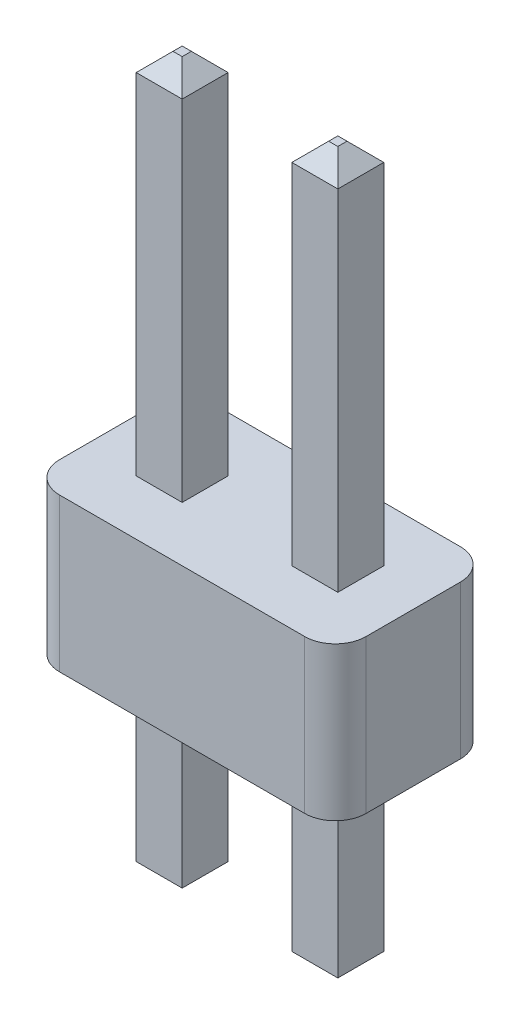
ISO-10303-21;
HEADER;
FILE_DESCRIPTION(('STEP AP214'),'2;1');
FILE_NAME('part.step','',(''),(''),'','','');
FILE_SCHEMA(('AUTOMOTIVE_DESIGN { 1 0 10303 214 1 1 1 1 }'));
ENDSEC;
DATA;
#1=APPLICATION_CONTEXT('core data for automotive mechanical design processes');
#2=APPLICATION_PROTOCOL_DEFINITION('international standard','automotive_design',2000,#1);
#3=PRODUCT_CONTEXT('',#1,'mechanical');
#4=PRODUCT('Part','Part','',(#3));
#5=PRODUCT_RELATED_PRODUCT_CATEGORY('part','',(#4));
#6=PRODUCT_DEFINITION_FORMATION('','',#4);
#7=PRODUCT_DEFINITION_CONTEXT('part definition',#1,'design');
#8=PRODUCT_DEFINITION('design','',#6,#7);
#9=PRODUCT_DEFINITION_SHAPE('','',#8);
#10=(LENGTH_UNIT() NAMED_UNIT(*) SI_UNIT(.MILLI.,.METRE.));
#11=(NAMED_UNIT(*) PLANE_ANGLE_UNIT() SI_UNIT($,.RADIAN.));
#12=(NAMED_UNIT(*) SI_UNIT($,.STERADIAN.) SOLID_ANGLE_UNIT());
#13=UNCERTAINTY_MEASURE_WITH_UNIT(LENGTH_MEASURE(1.E-05),#10,'distance_accuracy_value','');
#14=(GEOMETRIC_REPRESENTATION_CONTEXT(3) GLOBAL_UNCERTAINTY_ASSIGNED_CONTEXT((#13)) GLOBAL_UNIT_ASSIGNED_CONTEXT((#10,
#11,#12)) REPRESENTATION_CONTEXT('',''));
#15=CARTESIAN_POINT('',(0.,0.,0.));
#16=DIRECTION('',(0.,0.,1.));
#17=DIRECTION('',(1.,0.,0.));
#18=AXIS2_PLACEMENT_3D('',#15,#16,#17);
#19=CARTESIAN_POINT('',(2.,2.5,0.77));
#20=DIRECTION('',(0.,-1.,0.));
#21=DIRECTION('',(0.,0.,-1.));
#22=AXIS2_PLACEMENT_3D('',#19,#20,#21);
#23=CYLINDRICAL_SURFACE('',#22,0.5);
#24=CARTESIAN_POINT('',(2.,0.,0.77));
#25=DIRECTION('',(0.,1.,0.));
#26=DIRECTION('',(0.,0.,1.));
#27=AXIS2_PLACEMENT_3D('',#24,#25,#26);
#28=CIRCLE('',#27,0.5);
#29=CARTESIAN_POINT('',(2.,0.,1.27));
#30=VERTEX_POINT('',#29);
#31=CARTESIAN_POINT('',(2.5,0.,0.77));
#32=VERTEX_POINT('',#31);
#33=EDGE_CURVE('E303',#30,#32,#28,.T.);
#34=ORIENTED_EDGE('',*,*,#33,.T.);
#35=DIRECTION('',(0.,-1.,0.));
#36=VECTOR('',#35,1.);
#37=CARTESIAN_POINT('',(2.5,2.5,0.77));
#38=LINE('',#37,#36);
#39=CARTESIAN_POINT('',(2.5,2.5,0.77));
#40=VERTEX_POINT('',#39);
#41=EDGE_CURVE('E358',#40,#32,#38,.T.);
#42=ORIENTED_EDGE('',*,*,#41,.F.);
#43=CARTESIAN_POINT('',(2.,2.5,0.77));
#44=DIRECTION('',(0.,1.,0.));
#45=DIRECTION('',(0.,0.,1.));
#46=AXIS2_PLACEMENT_3D('',#43,#44,#45);
#47=CIRCLE('',#46,0.5);
#48=CARTESIAN_POINT('',(2.,2.5,1.27));
#49=VERTEX_POINT('',#48);
#50=EDGE_CURVE('E304',#49,#40,#47,.T.);
#51=ORIENTED_EDGE('',*,*,#50,.F.);
#52=DIRECTION('',(0.,-1.,0.));
#53=VECTOR('',#52,1.);
#54=CARTESIAN_POINT('',(2.,2.5,1.27));
#55=LINE('',#54,#53);
#56=EDGE_CURVE('E322',#49,#30,#55,.T.);
#57=ORIENTED_EDGE('',*,*,#56,.T.);
#58=EDGE_LOOP('',(#34,#42,#51,#57));
#59=FACE_BOUND('',#58,.T.);
#60=ADVANCED_FACE('F37',(#59),#23,.T.);
#61=CARTESIAN_POINT('',(2.5,2.5,-0.77));
#62=DIRECTION('',(-1.,0.,0.));
#63=DIRECTION('',(0.,0.,1.));
#64=AXIS2_PLACEMENT_3D('',#61,#62,#63);
#65=PLANE('',#64);
#66=DIRECTION('',(0.,0.,-1.));
#67=VECTOR('',#66,1.);
#68=CARTESIAN_POINT('',(2.5,0.,-0.77));
#69=LINE('',#68,#67);
#70=CARTESIAN_POINT('',(2.5,0.,-0.77));
#71=VERTEX_POINT('',#70);
#72=EDGE_CURVE('E325',#32,#71,#69,.T.);
#73=ORIENTED_EDGE('',*,*,#72,.T.);
#74=DIRECTION('',(0.,-1.,0.));
#75=VECTOR('',#74,1.);
#76=CARTESIAN_POINT('',(2.5,2.5,-0.77));
#77=LINE('',#76,#75);
#78=CARTESIAN_POINT('',(2.5,2.5,-0.77));
#79=VERTEX_POINT('',#78);
#80=EDGE_CURVE('E355',#79,#71,#77,.T.);
#81=ORIENTED_EDGE('',*,*,#80,.F.);
#82=DIRECTION('',(0.,0.,-1.));
#83=VECTOR('',#82,1.);
#84=CARTESIAN_POINT('',(2.5,2.5,-0.77));
#85=LINE('',#84,#83);
#86=EDGE_CURVE('E307',#40,#79,#85,.T.);
#87=ORIENTED_EDGE('',*,*,#86,.F.);
#88=ORIENTED_EDGE('',*,*,#41,.T.);
#89=EDGE_LOOP('',(#73,#81,#87,#88));
#90=FACE_BOUND('',#89,.T.);
#91=ADVANCED_FACE('F524',(#90),#65,.F.);
#92=CARTESIAN_POINT('',(2.,2.5,-0.77));
#93=DIRECTION('',(0.,-1.,0.));
#94=DIRECTION('',(0.,0.,-1.));
#95=AXIS2_PLACEMENT_3D('',#92,#93,#94);
#96=CYLINDRICAL_SURFACE('',#95,0.5);
#97=CARTESIAN_POINT('',(2.,0.,-0.77));
#98=DIRECTION('',(0.,1.,0.));
#99=DIRECTION('',(0.,0.,1.));
#100=AXIS2_PLACEMENT_3D('',#97,#98,#99);
#101=CIRCLE('',#100,0.5);
#102=CARTESIAN_POINT('',(2.,0.,-1.27));
#103=VERTEX_POINT('',#102);
#104=EDGE_CURVE('E327',#71,#103,#101,.T.);
#105=ORIENTED_EDGE('',*,*,#104,.T.);
#106=DIRECTION('',(0.,-1.,0.));
#107=VECTOR('',#106,1.);
#108=CARTESIAN_POINT('',(2.,2.5,-1.27));
#109=LINE('',#108,#107);
#110=CARTESIAN_POINT('',(2.,2.5,-1.27));
#111=VERTEX_POINT('',#110);
#112=EDGE_CURVE('E352',#111,#103,#109,.T.);
#113=ORIENTED_EDGE('',*,*,#112,.F.);
#114=CARTESIAN_POINT('',(2.,2.5,-0.77));
#115=DIRECTION('',(0.,1.,0.));
#116=DIRECTION('',(0.,0.,1.));
#117=AXIS2_PLACEMENT_3D('',#114,#115,#116);
#118=CIRCLE('',#117,0.5);
#119=EDGE_CURVE('E310',#79,#111,#118,.T.);
#120=ORIENTED_EDGE('',*,*,#119,.F.);
#121=ORIENTED_EDGE('',*,*,#80,.T.);
#122=EDGE_LOOP('',(#105,#113,#120,#121));
#123=FACE_BOUND('',#122,.T.);
#124=ADVANCED_FACE('F530',(#123),#96,.T.);
#125=CARTESIAN_POINT('',(-2.,2.5,-1.27));
#126=DIRECTION('',(0.,0.,1.));
#127=DIRECTION('',(1.,0.,0.));
#128=AXIS2_PLACEMENT_3D('',#125,#126,#127);
#129=PLANE('',#128);
#130=DIRECTION('',(-1.,0.,0.));
#131=VECTOR('',#130,1.);
#132=CARTESIAN_POINT('',(-2.,0.,-1.27));
#133=LINE('',#132,#131);
#134=CARTESIAN_POINT('',(-2.,0.,-1.27));
#135=VERTEX_POINT('',#134);
#136=EDGE_CURVE('E329',#103,#135,#133,.T.);
#137=ORIENTED_EDGE('',*,*,#136,.T.);
#138=DIRECTION('',(0.,-1.,0.));
#139=VECTOR('',#138,1.);
#140=CARTESIAN_POINT('',(-2.,2.5,-1.27));
#141=LINE('',#140,#139);
#142=CARTESIAN_POINT('',(-2.,2.5,-1.27));
#143=VERTEX_POINT('',#142);
#144=EDGE_CURVE('E349',#143,#135,#141,.T.);
#145=ORIENTED_EDGE('',*,*,#144,.F.);
#146=DIRECTION('',(-1.,0.,0.));
#147=VECTOR('',#146,1.);
#148=CARTESIAN_POINT('',(-2.,2.5,-1.27));
#149=LINE('',#148,#147);
#150=EDGE_CURVE('E312',#111,#143,#149,.T.);
#151=ORIENTED_EDGE('',*,*,#150,.F.);
#152=ORIENTED_EDGE('',*,*,#112,.T.);
#153=EDGE_LOOP('',(#137,#145,#151,#152));
#154=FACE_BOUND('',#153,.T.);
#155=ADVANCED_FACE('F874',(#154),#129,.F.);
#156=CARTESIAN_POINT('',(-2.,2.5,-0.77));
#157=DIRECTION('',(0.,-1.,0.));
#158=DIRECTION('',(0.,0.,-1.));
#159=AXIS2_PLACEMENT_3D('',#156,#157,#158);
#160=CYLINDRICAL_SURFACE('',#159,0.5);
#161=CARTESIAN_POINT('',(-2.,0.,-0.77));
#162=DIRECTION('',(0.,1.,0.));
#163=DIRECTION('',(0.,0.,1.));
#164=AXIS2_PLACEMENT_3D('',#161,#162,#163);
#165=CIRCLE('',#164,0.5);
#166=CARTESIAN_POINT('',(-2.5,0.,-0.77));
#167=VERTEX_POINT('',#166);
#168=EDGE_CURVE('E331',#135,#167,#165,.T.);
#169=ORIENTED_EDGE('',*,*,#168,.T.);
#170=DIRECTION('',(0.,-1.,0.));
#171=VECTOR('',#170,1.);
#172=CARTESIAN_POINT('',(-2.5,2.5,-0.77));
#173=LINE('',#172,#171);
#174=CARTESIAN_POINT('',(-2.5,2.5,-0.77));
#175=VERTEX_POINT('',#174);
#176=EDGE_CURVE('E346',#175,#167,#173,.T.);
#177=ORIENTED_EDGE('',*,*,#176,.F.);
#178=CARTESIAN_POINT('',(-2.,2.5,-0.77));
#179=DIRECTION('',(0.,1.,0.));
#180=DIRECTION('',(0.,0.,1.));
#181=AXIS2_PLACEMENT_3D('',#178,#179,#180);
#182=CIRCLE('',#181,0.5);
#183=EDGE_CURVE('E314',#143,#175,#182,.T.);
#184=ORIENTED_EDGE('',*,*,#183,.F.);
#185=ORIENTED_EDGE('',*,*,#144,.T.);
#186=EDGE_LOOP('',(#169,#177,#184,#185));
#187=FACE_BOUND('',#186,.T.);
#188=ADVANCED_FACE('F863',(#187),#160,.T.);
#189=CARTESIAN_POINT('',(-2.5,2.5,0.77));
#190=DIRECTION('',(1.,0.,0.));
#191=DIRECTION('',(0.,0.,-1.));
#192=AXIS2_PLACEMENT_3D('',#189,#190,#191);
#193=PLANE('',#192);
#194=DIRECTION('',(0.,0.,1.));
#195=VECTOR('',#194,1.);
#196=CARTESIAN_POINT('',(-2.5,0.,0.77));
#197=LINE('',#196,#195);
#198=CARTESIAN_POINT('',(-2.5,0.,0.77));
#199=VERTEX_POINT('',#198);
#200=EDGE_CURVE('E333',#167,#199,#197,.T.);
#201=ORIENTED_EDGE('',*,*,#200,.T.);
#202=DIRECTION('',(0.,-1.,0.));
#203=VECTOR('',#202,1.);
#204=CARTESIAN_POINT('',(-2.5,2.5,0.77));
#205=LINE('',#204,#203);
#206=CARTESIAN_POINT('',(-2.5,2.5,0.77));
#207=VERTEX_POINT('',#206);
#208=EDGE_CURVE('E343',#207,#199,#205,.T.);
#209=ORIENTED_EDGE('',*,*,#208,.F.);
#210=DIRECTION('',(0.,0.,1.));
#211=VECTOR('',#210,1.);
#212=CARTESIAN_POINT('',(-2.5,2.5,0.77));
#213=LINE('',#212,#211);
#214=EDGE_CURVE('E316',#175,#207,#213,.T.);
#215=ORIENTED_EDGE('',*,*,#214,.F.);
#216=ORIENTED_EDGE('',*,*,#176,.T.);
#217=EDGE_LOOP('',(#201,#209,#215,#216));
#218=FACE_BOUND('',#217,.T.);
#219=ADVANCED_FACE('F852',(#218),#193,.F.);
#220=CARTESIAN_POINT('',(-2.,2.5,0.77));
#221=DIRECTION('',(0.,-1.,0.));
#222=DIRECTION('',(0.,0.,-1.));
#223=AXIS2_PLACEMENT_3D('',#220,#221,#222);
#224=CYLINDRICAL_SURFACE('',#223,0.5);
#225=CARTESIAN_POINT('',(-2.,0.,0.77));
#226=DIRECTION('',(0.,1.,0.));
#227=DIRECTION('',(0.,0.,1.));
#228=AXIS2_PLACEMENT_3D('',#225,#226,#227);
#229=CIRCLE('',#228,0.5);
#230=CARTESIAN_POINT('',(-2.,0.,1.27));
#231=VERTEX_POINT('',#230);
#232=EDGE_CURVE('E335',#199,#231,#229,.T.);
#233=ORIENTED_EDGE('',*,*,#232,.T.);
#234=DIRECTION('',(0.,-1.,0.));
#235=VECTOR('',#234,1.);
#236=CARTESIAN_POINT('',(-2.,2.5,1.27));
#237=LINE('',#236,#235);
#238=CARTESIAN_POINT('',(-2.,2.5,1.27));
#239=VERTEX_POINT('',#238);
#240=EDGE_CURVE('E340',#239,#231,#237,.T.);
#241=ORIENTED_EDGE('',*,*,#240,.F.);
#242=CARTESIAN_POINT('',(-2.,2.5,0.77));
#243=DIRECTION('',(0.,1.,0.));
#244=DIRECTION('',(0.,0.,1.));
#245=AXIS2_PLACEMENT_3D('',#242,#243,#244);
#246=CIRCLE('',#245,0.5);
#247=EDGE_CURVE('E318',#207,#239,#246,.T.);
#248=ORIENTED_EDGE('',*,*,#247,.F.);
#249=ORIENTED_EDGE('',*,*,#208,.T.);
#250=EDGE_LOOP('',(#233,#241,#248,#249));
#251=FACE_BOUND('',#250,.T.);
#252=ADVANCED_FACE('F841',(#251),#224,.T.);
#253=CARTESIAN_POINT('',(2.,2.5,1.27));
#254=DIRECTION('',(0.,0.,-1.));
#255=DIRECTION('',(-1.,0.,0.));
#256=AXIS2_PLACEMENT_3D('',#253,#254,#255);
#257=PLANE('',#256);
#258=DIRECTION('',(1.,0.,0.));
#259=VECTOR('',#258,1.);
#260=CARTESIAN_POINT('',(2.,0.,1.27));
#261=LINE('',#260,#259);
#262=EDGE_CURVE('E308',#231,#30,#261,.T.);
#263=ORIENTED_EDGE('',*,*,#262,.T.);
#264=ORIENTED_EDGE('',*,*,#56,.F.);
#265=DIRECTION('',(1.,0.,0.));
#266=VECTOR('',#265,1.);
#267=CARTESIAN_POINT('',(2.,2.5,1.27));
#268=LINE('',#267,#266);
#269=EDGE_CURVE('E320',#239,#49,#268,.T.);
#270=ORIENTED_EDGE('',*,*,#269,.F.);
#271=ORIENTED_EDGE('',*,*,#240,.T.);
#272=EDGE_LOOP('',(#263,#264,#270,#271));
#273=FACE_BOUND('',#272,.T.);
#274=ADVANCED_FACE('F831',(#273),#257,.F.);
#275=CARTESIAN_POINT('',(2.,2.5,0.77));
#276=DIRECTION('',(0.,1.,0.));
#277=DIRECTION('',(0.,0.,1.));
#278=AXIS2_PLACEMENT_3D('',#275,#276,#277);
#279=PLANE('',#278);
#280=DIRECTION('',(0.,0.,1.));
#281=VECTOR('',#280,1.);
#282=CARTESIAN_POINT('',(0.895,2.5,0.77));
#283=LINE('',#282,#281);
#284=CARTESIAN_POINT('',(0.895,2.5,-0.375));
#285=VERTEX_POINT('',#284);
#286=CARTESIAN_POINT('',(0.895,2.5,0.375));
#287=VERTEX_POINT('',#286);
#288=EDGE_CURVE('E277',#285,#287,#283,.T.);
#289=ORIENTED_EDGE('',*,*,#288,.F.);
#290=DIRECTION('',(-1.,0.,0.));
#291=VECTOR('',#290,1.);
#292=CARTESIAN_POINT('',(2.,2.5,-0.375));
#293=LINE('',#292,#291);
#294=CARTESIAN_POINT('',(1.645,2.5,-0.375));
#295=VERTEX_POINT('',#294);
#296=EDGE_CURVE('E255',#295,#285,#293,.T.);
#297=ORIENTED_EDGE('',*,*,#296,.F.);
#298=DIRECTION('',(0.,0.,-1.));
#299=VECTOR('',#298,1.);
#300=CARTESIAN_POINT('',(1.645,2.5,0.77));
#301=LINE('',#300,#299);
#302=CARTESIAN_POINT('',(1.645,2.5,0.375));
#303=VERTEX_POINT('',#302);
#304=EDGE_CURVE('E248',#303,#295,#301,.T.);
#305=ORIENTED_EDGE('',*,*,#304,.F.);
#306=DIRECTION('',(1.,0.,0.));
#307=VECTOR('',#306,1.);
#308=CARTESIAN_POINT('',(2.,2.5,0.375));
#309=LINE('',#308,#307);
#310=EDGE_CURVE('E252',#287,#303,#309,.T.);
#311=ORIENTED_EDGE('',*,*,#310,.F.);
#312=EDGE_LOOP('',(#289,#297,#305,#311));
#313=FACE_BOUND('',#312,.T.);
#314=DIRECTION('',(0.,0.,-1.));
#315=VECTOR('',#314,1.);
#316=CARTESIAN_POINT('',(-0.895,2.5,0.77));
#317=LINE('',#316,#315);
#318=CARTESIAN_POINT('',(-0.895,2.5,0.375));
#319=VERTEX_POINT('',#318);
#320=CARTESIAN_POINT('',(-0.895,2.5,-0.375));
#321=VERTEX_POINT('',#320);
#322=EDGE_CURVE('E300',#319,#321,#317,.T.);
#323=ORIENTED_EDGE('',*,*,#322,.F.);
#324=DIRECTION('',(1.,0.,0.));
#325=VECTOR('',#324,1.);
#326=CARTESIAN_POINT('',(2.,2.5,0.375));
#327=LINE('',#326,#325);
#328=CARTESIAN_POINT('',(-1.645,2.5,0.375));
#329=VERTEX_POINT('',#328);
#330=EDGE_CURVE('E297',#329,#319,#327,.T.);
#331=ORIENTED_EDGE('',*,*,#330,.F.);
#332=DIRECTION('',(0.,0.,1.));
#333=VECTOR('',#332,1.);
#334=CARTESIAN_POINT('',(-1.645,2.5,0.77));
#335=LINE('',#334,#333);
#336=CARTESIAN_POINT('',(-1.645,2.5,-0.375));
#337=VERTEX_POINT('',#336);
#338=EDGE_CURVE('E294',#337,#329,#335,.T.);
#339=ORIENTED_EDGE('',*,*,#338,.F.);
#340=DIRECTION('',(-1.,0.,0.));
#341=VECTOR('',#340,1.);
#342=CARTESIAN_POINT('',(2.,2.5,-0.375));
#343=LINE('',#342,#341);
#344=EDGE_CURVE('E282',#321,#337,#343,.T.);
#345=ORIENTED_EDGE('',*,*,#344,.F.);
#346=EDGE_LOOP('',(#323,#331,#339,#345));
#347=FACE_BOUND('',#346,.T.);
#348=ORIENTED_EDGE('',*,*,#50,.T.);
#349=ORIENTED_EDGE('',*,*,#86,.T.);
#350=ORIENTED_EDGE('',*,*,#119,.T.);
#351=ORIENTED_EDGE('',*,*,#150,.T.);
#352=ORIENTED_EDGE('',*,*,#183,.T.);
#353=ORIENTED_EDGE('',*,*,#214,.T.);
#354=ORIENTED_EDGE('',*,*,#247,.T.);
#355=ORIENTED_EDGE('',*,*,#269,.T.);
#356=EDGE_LOOP('',(#348,#349,#350,#351,#352,#353,#354,#355));
#357=FACE_BOUND('',#356,.T.);
#358=ADVANCED_FACE('F250',(#313,#347,#357),#279,.T.);
#359=CARTESIAN_POINT('',(2.,0.,0.77));
#360=DIRECTION('',(0.,1.,0.));
#361=DIRECTION('',(0.,0.,1.));
#362=AXIS2_PLACEMENT_3D('',#359,#360,#361);
#363=PLANE('',#362);
#364=DIRECTION('',(-1.,0.,0.));
#365=VECTOR('',#364,1.);
#366=CARTESIAN_POINT('',(2.,0.,-0.375));
#367=LINE('',#366,#365);
#368=CARTESIAN_POINT('',(1.645,0.,-0.375));
#369=VERTEX_POINT('',#368);
#370=CARTESIAN_POINT('',(0.895,0.,-0.375));
#371=VERTEX_POINT('',#370);
#372=EDGE_CURVE('E379',#369,#371,#367,.T.);
#373=ORIENTED_EDGE('',*,*,#372,.T.);
#374=DIRECTION('',(0.,0.,1.));
#375=VECTOR('',#374,1.);
#376=CARTESIAN_POINT('',(0.895,0.,0.77));
#377=LINE('',#376,#375);
#378=CARTESIAN_POINT('',(0.895,0.,0.375));
#379=VERTEX_POINT('',#378);
#380=EDGE_CURVE('E382',#371,#379,#377,.T.);
#381=ORIENTED_EDGE('',*,*,#380,.T.);
#382=DIRECTION('',(1.,0.,0.));
#383=VECTOR('',#382,1.);
#384=CARTESIAN_POINT('',(2.,0.,0.375));
#385=LINE('',#384,#383);
#386=CARTESIAN_POINT('',(1.645,0.,0.375));
#387=VERTEX_POINT('',#386);
#388=EDGE_CURVE('E373',#379,#387,#385,.T.);
#389=ORIENTED_EDGE('',*,*,#388,.T.);
#390=DIRECTION('',(0.,0.,-1.));
#391=VECTOR('',#390,1.);
#392=CARTESIAN_POINT('',(1.645,0.,0.77));
#393=LINE('',#392,#391);
#394=EDGE_CURVE('E376',#387,#369,#393,.T.);
#395=ORIENTED_EDGE('',*,*,#394,.T.);
#396=EDGE_LOOP('',(#373,#381,#389,#395));
#397=FACE_BOUND('',#396,.T.);
#398=DIRECTION('',(1.,0.,0.));
#399=VECTOR('',#398,1.);
#400=CARTESIAN_POINT('',(2.,0.,0.375));
#401=LINE('',#400,#399);
#402=CARTESIAN_POINT('',(-1.645,0.,0.375));
#403=VERTEX_POINT('',#402);
#404=CARTESIAN_POINT('',(-0.895,0.,0.375));
#405=VERTEX_POINT('',#404);
#406=EDGE_CURVE('E367',#403,#405,#401,.T.);
#407=ORIENTED_EDGE('',*,*,#406,.T.);
#408=DIRECTION('',(0.,0.,-1.));
#409=VECTOR('',#408,1.);
#410=CARTESIAN_POINT('',(-0.895,0.,0.77));
#411=LINE('',#410,#409);
#412=CARTESIAN_POINT('',(-0.895,0.,-0.375));
#413=VERTEX_POINT('',#412);
#414=EDGE_CURVE('E370',#405,#413,#411,.T.);
#415=ORIENTED_EDGE('',*,*,#414,.T.);
#416=DIRECTION('',(-1.,0.,0.));
#417=VECTOR('',#416,1.);
#418=CARTESIAN_POINT('',(2.,0.,-0.375));
#419=LINE('',#418,#417);
#420=CARTESIAN_POINT('',(-1.645,0.,-0.375));
#421=VERTEX_POINT('',#420);
#422=EDGE_CURVE('E361',#413,#421,#419,.T.);
#423=ORIENTED_EDGE('',*,*,#422,.T.);
#424=DIRECTION('',(0.,0.,1.));
#425=VECTOR('',#424,1.);
#426=CARTESIAN_POINT('',(-1.645,0.,0.77));
#427=LINE('',#426,#425);
#428=EDGE_CURVE('E364',#421,#403,#427,.T.);
#429=ORIENTED_EDGE('',*,*,#428,.T.);
#430=EDGE_LOOP('',(#407,#415,#423,#429));
#431=FACE_BOUND('',#430,.T.);
#432=ORIENTED_EDGE('',*,*,#33,.F.);
#433=ORIENTED_EDGE('',*,*,#262,.F.);
#434=ORIENTED_EDGE('',*,*,#232,.F.);
#435=ORIENTED_EDGE('',*,*,#200,.F.);
#436=ORIENTED_EDGE('',*,*,#168,.F.);
#437=ORIENTED_EDGE('',*,*,#136,.F.);
#438=ORIENTED_EDGE('',*,*,#104,.F.);
#439=ORIENTED_EDGE('',*,*,#72,.F.);
#440=EDGE_LOOP('',(#432,#433,#434,#435,#436,#437,#438,#439));
#441=FACE_BOUND('',#440,.T.);
#442=ADVANCED_FACE('F810',(#397,#431,#441),#363,.F.);
#443=CARTESIAN_POINT('',(0.,-3.25,0.));
#444=DIRECTION('',(0.,-1.,0.));
#445=DIRECTION('',(0.,0.,-1.));
#446=AXIS2_PLACEMENT_3D('',#443,#444,#445);
#447=PLANE('',#446);
#448=DIRECTION('',(0.,0.,1.));
#449=VECTOR('',#448,1.);
#450=CARTESIAN_POINT('',(-1.195,-3.25,0.));
#451=LINE('',#450,#449);
#452=CARTESIAN_POINT('',(-1.195,-3.25,-0.0750000000000004));
#453=VERTEX_POINT('',#452);
#454=CARTESIAN_POINT('',(-1.195,-3.25,0.075));
#455=VERTEX_POINT('',#454);
#456=EDGE_CURVE('E408',#453,#455,#451,.T.);
#457=ORIENTED_EDGE('',*,*,#456,.T.);
#458=DIRECTION('',(-1.,0.,0.));
#459=VECTOR('',#458,1.);
#460=CARTESIAN_POINT('',(0.,-3.25,0.075));
#461=LINE('',#460,#459);
#462=CARTESIAN_POINT('',(-1.345,-3.25,0.075));
#463=VERTEX_POINT('',#462);
#464=EDGE_CURVE('E412',#455,#463,#461,.T.);
#465=ORIENTED_EDGE('',*,*,#464,.T.);
#466=DIRECTION('',(0.,0.,-1.));
#467=VECTOR('',#466,1.);
#468=CARTESIAN_POINT('',(-1.345,-3.25,0.));
#469=LINE('',#468,#467);
#470=CARTESIAN_POINT('',(-1.345,-3.25,-0.0750000000000004));
#471=VERTEX_POINT('',#470);
#472=EDGE_CURVE('E410',#463,#471,#469,.T.);
#473=ORIENTED_EDGE('',*,*,#472,.T.);
#474=DIRECTION('',(1.,0.,0.));
#475=VECTOR('',#474,1.);
#476=CARTESIAN_POINT('',(0.,-3.25,-0.0750000000000004));
#477=LINE('',#476,#475);
#478=EDGE_CURVE('E406',#471,#453,#477,.T.);
#479=ORIENTED_EDGE('',*,*,#478,.T.);
#480=EDGE_LOOP('',(#457,#465,#473,#479));
#481=FACE_BOUND('',#480,.T.);
#482=ADVANCED_FACE('F801',(#481),#447,.T.);
#483=CARTESIAN_POINT('',(-1.645,-3.25,-0.375));
#484=DIRECTION('',(0.,0.,-1.));
#485=DIRECTION('',(-1.,0.,0.));
#486=AXIS2_PLACEMENT_3D('',#483,#484,#485);
#487=PLANE('',#486);
#488=DIRECTION('',(0.,1.,0.));
#489=VECTOR('',#488,1.);
#490=CARTESIAN_POINT('',(-0.895,-3.25,-0.375));
#491=LINE('',#490,#489);
#492=CARTESIAN_POINT('',(-0.895,-2.95,-0.375));
#493=VERTEX_POINT('',#492);
#494=EDGE_CURVE('E290',#493,#413,#491,.T.);
#495=ORIENTED_EDGE('',*,*,#494,.F.);
#496=DIRECTION('',(-1.,0.,0.));
#497=VECTOR('',#496,1.);
#498=CARTESIAN_POINT('',(-1.645,-2.95,-0.375));
#499=LINE('',#498,#497);
#500=CARTESIAN_POINT('',(-1.645,-2.95,-0.375));
#501=VERTEX_POINT('',#500);
#502=EDGE_CURVE('E419',#493,#501,#499,.T.);
#503=ORIENTED_EDGE('',*,*,#502,.T.);
#504=DIRECTION('',(0.,1.,0.));
#505=VECTOR('',#504,1.);
#506=CARTESIAN_POINT('',(-1.645,-3.25,-0.375));
#507=LINE('',#506,#505);
#508=EDGE_CURVE('E287',#501,#421,#507,.T.);
#509=ORIENTED_EDGE('',*,*,#508,.T.);
#510=ORIENTED_EDGE('',*,*,#422,.F.);
#511=EDGE_LOOP('',(#495,#503,#509,#510));
#512=FACE_BOUND('',#511,.T.);
#513=ADVANCED_FACE('F737',(#512),#487,.T.);
#514=CARTESIAN_POINT('',(-1.645,-3.25,0.375));
#515=DIRECTION('',(-1.,0.,0.));
#516=DIRECTION('',(0.,0.,1.));
#517=AXIS2_PLACEMENT_3D('',#514,#515,#516);
#518=PLANE('',#517);
#519=ORIENTED_EDGE('',*,*,#508,.F.);
#520=DIRECTION('',(0.,0.,1.));
#521=VECTOR('',#520,1.);
#522=CARTESIAN_POINT('',(-1.645,-2.95,0.375));
#523=LINE('',#522,#521);
#524=CARTESIAN_POINT('',(-1.645,-2.95,0.375));
#525=VERTEX_POINT('',#524);
#526=EDGE_CURVE('E415',#501,#525,#523,.T.);
#527=ORIENTED_EDGE('',*,*,#526,.T.);
#528=DIRECTION('',(0.,1.,0.));
#529=VECTOR('',#528,1.);
#530=CARTESIAN_POINT('',(-1.645,-3.25,0.375));
#531=LINE('',#530,#529);
#532=EDGE_CURVE('E284',#525,#403,#531,.T.);
#533=ORIENTED_EDGE('',*,*,#532,.T.);
#534=ORIENTED_EDGE('',*,*,#428,.F.);
#535=EDGE_LOOP('',(#519,#527,#533,#534));
#536=FACE_BOUND('',#535,.T.);
#537=ADVANCED_FACE('F748',(#536),#518,.T.);
#538=CARTESIAN_POINT('',(-0.895,-3.25,0.375));
#539=DIRECTION('',(0.,0.,1.));
#540=DIRECTION('',(1.,0.,0.));
#541=AXIS2_PLACEMENT_3D('',#538,#539,#540);
#542=PLANE('',#541);
#543=ORIENTED_EDGE('',*,*,#532,.F.);
#544=DIRECTION('',(1.,0.,0.));
#545=VECTOR('',#544,1.);
#546=CARTESIAN_POINT('',(-0.895,-2.95,0.375));
#547=LINE('',#546,#545);
#548=CARTESIAN_POINT('',(-0.895,-2.95,0.375));
#549=VERTEX_POINT('',#548);
#550=EDGE_CURVE('E403',#525,#549,#547,.T.);
#551=ORIENTED_EDGE('',*,*,#550,.T.);
#552=DIRECTION('',(0.,1.,0.));
#553=VECTOR('',#552,1.);
#554=CARTESIAN_POINT('',(-0.895,-3.25,0.375));
#555=LINE('',#554,#553);
#556=EDGE_CURVE('E280',#549,#405,#555,.T.);
#557=ORIENTED_EDGE('',*,*,#556,.T.);
#558=ORIENTED_EDGE('',*,*,#406,.F.);
#559=EDGE_LOOP('',(#543,#551,#557,#558));
#560=FACE_BOUND('',#559,.T.);
#561=ADVANCED_FACE('F759',(#560),#542,.T.);
#562=CARTESIAN_POINT('',(-0.895,-3.25,-0.375));
#563=DIRECTION('',(1.,0.,0.));
#564=DIRECTION('',(0.,0.,-1.));
#565=AXIS2_PLACEMENT_3D('',#562,#563,#564);
#566=PLANE('',#565);
#567=ORIENTED_EDGE('',*,*,#556,.F.);
#568=DIRECTION('',(0.,0.,-1.));
#569=VECTOR('',#568,1.);
#570=CARTESIAN_POINT('',(-0.895,-2.95,-0.375));
#571=LINE('',#570,#569);
#572=EDGE_CURVE('E417',#549,#493,#571,.T.);
#573=ORIENTED_EDGE('',*,*,#572,.T.);
#574=ORIENTED_EDGE('',*,*,#494,.T.);
#575=ORIENTED_EDGE('',*,*,#414,.F.);
#576=EDGE_LOOP('',(#567,#573,#574,#575));
#577=FACE_BOUND('',#576,.T.);
#578=ADVANCED_FACE('F767',(#577),#566,.T.);
#579=CARTESIAN_POINT('',(-0.895,8.2,-0.375));
#580=VERTEX_POINT('',#579);
#581=EDGE_CURVE('E279',#321,#580,#491,.T.);
#582=ORIENTED_EDGE('',*,*,#581,.T.);
#583=DIRECTION('',(0.,0.,1.));
#584=VECTOR('',#583,1.);
#585=CARTESIAN_POINT('',(-0.895,8.2,0.375));
#586=LINE('',#585,#584);
#587=CARTESIAN_POINT('',(-0.895,8.2,0.375));
#588=VERTEX_POINT('',#587);
#589=EDGE_CURVE('E435',#580,#588,#586,.T.);
#590=ORIENTED_EDGE('',*,*,#589,.T.);
#591=EDGE_CURVE('E283',#319,#588,#555,.T.);
#592=ORIENTED_EDGE('',*,*,#591,.F.);
#593=ORIENTED_EDGE('',*,*,#322,.T.);
#594=EDGE_LOOP('',(#582,#590,#592,#593));
#595=FACE_BOUND('',#594,.T.);
#596=ADVANCED_FACE('F756',(#595),#566,.T.);
#597=ORIENTED_EDGE('',*,*,#591,.T.);
#598=DIRECTION('',(-1.,0.,0.));
#599=VECTOR('',#598,1.);
#600=CARTESIAN_POINT('',(-1.645,8.2,0.375));
#601=LINE('',#600,#599);
#602=CARTESIAN_POINT('',(-1.645,8.2,0.375));
#603=VERTEX_POINT('',#602);
#604=EDGE_CURVE('E437',#588,#603,#601,.T.);
#605=ORIENTED_EDGE('',*,*,#604,.T.);
#606=EDGE_CURVE('E286',#329,#603,#531,.T.);
#607=ORIENTED_EDGE('',*,*,#606,.F.);
#608=ORIENTED_EDGE('',*,*,#330,.T.);
#609=EDGE_LOOP('',(#597,#605,#607,#608));
#610=FACE_BOUND('',#609,.T.);
#611=ADVANCED_FACE('F745',(#610),#542,.T.);
#612=ORIENTED_EDGE('',*,*,#606,.T.);
#613=DIRECTION('',(0.,0.,-1.));
#614=VECTOR('',#613,1.);
#615=CARTESIAN_POINT('',(-1.645,8.2,-0.375));
#616=LINE('',#615,#614);
#617=CARTESIAN_POINT('',(-1.645,8.2,-0.375));
#618=VERTEX_POINT('',#617);
#619=EDGE_CURVE('E430',#603,#618,#616,.T.);
#620=ORIENTED_EDGE('',*,*,#619,.T.);
#621=EDGE_CURVE('E289',#337,#618,#507,.T.);
#622=ORIENTED_EDGE('',*,*,#621,.F.);
#623=ORIENTED_EDGE('',*,*,#338,.T.);
#624=EDGE_LOOP('',(#612,#620,#622,#623));
#625=FACE_BOUND('',#624,.T.);
#626=ADVANCED_FACE('F734',(#625),#518,.T.);
#627=ORIENTED_EDGE('',*,*,#621,.T.);
#628=DIRECTION('',(1.,0.,0.));
#629=VECTOR('',#628,1.);
#630=CARTESIAN_POINT('',(-0.895,8.2,-0.375));
#631=LINE('',#630,#629);
#632=EDGE_CURVE('E433',#618,#580,#631,.T.);
#633=ORIENTED_EDGE('',*,*,#632,.T.);
#634=ORIENTED_EDGE('',*,*,#581,.F.);
#635=ORIENTED_EDGE('',*,*,#344,.T.);
#636=EDGE_LOOP('',(#627,#633,#634,#635));
#637=FACE_BOUND('',#636,.T.);
#638=ADVANCED_FACE('F724',(#637),#487,.T.);
#639=CARTESIAN_POINT('',(0.,8.5,0.));
#640=DIRECTION('',(0.,-1.,0.));
#641=DIRECTION('',(0.,0.,-1.));
#642=AXIS2_PLACEMENT_3D('',#639,#640,#641);
#643=PLANE('',#642);
#644=DIRECTION('',(-1.,0.,0.));
#645=VECTOR('',#644,1.);
#646=CARTESIAN_POINT('',(-1.645,8.5,-0.0750000000000004));
#647=LINE('',#646,#645);
#648=CARTESIAN_POINT('',(-1.195,8.5,-0.0750000000000004));
#649=VERTEX_POINT('',#648);
#650=CARTESIAN_POINT('',(-1.345,8.5,-0.0750000000000004));
#651=VERTEX_POINT('',#650);
#652=EDGE_CURVE('E425',#649,#651,#647,.T.);
#653=ORIENTED_EDGE('',*,*,#652,.T.);
#654=DIRECTION('',(0.,0.,1.));
#655=VECTOR('',#654,1.);
#656=CARTESIAN_POINT('',(-1.345,8.5,0.375));
#657=LINE('',#656,#655);
#658=CARTESIAN_POINT('',(-1.345,8.5,0.075));
#659=VERTEX_POINT('',#658);
#660=EDGE_CURVE('E427',#651,#659,#657,.T.);
#661=ORIENTED_EDGE('',*,*,#660,.T.);
#662=DIRECTION('',(1.,0.,0.));
#663=VECTOR('',#662,1.);
#664=CARTESIAN_POINT('',(-0.895,8.5,0.075));
#665=LINE('',#664,#663);
#666=CARTESIAN_POINT('',(-1.195,8.5,0.075));
#667=VERTEX_POINT('',#666);
#668=EDGE_CURVE('E421',#659,#667,#665,.T.);
#669=ORIENTED_EDGE('',*,*,#668,.T.);
#670=DIRECTION('',(0.,0.,-1.));
#671=VECTOR('',#670,1.);
#672=CARTESIAN_POINT('',(-1.195,8.5,-0.375));
#673=LINE('',#672,#671);
#674=EDGE_CURVE('E423',#667,#649,#673,.T.);
#675=ORIENTED_EDGE('',*,*,#674,.T.);
#676=EDGE_LOOP('',(#653,#661,#669,#675));
#677=FACE_BOUND('',#676,.T.);
#678=ADVANCED_FACE('F715',(#677),#643,.F.);
#679=CARTESIAN_POINT('',(0.,-3.25,0.));
#680=DIRECTION('',(0.,-1.,0.));
#681=DIRECTION('',(0.,0.,-1.));
#682=AXIS2_PLACEMENT_3D('',#679,#680,#681);
#683=PLANE('',#682);
#684=DIRECTION('',(0.,0.,-1.));
#685=VECTOR('',#684,1.);
#686=CARTESIAN_POINT('',(1.195,-3.25,0.));
#687=LINE('',#686,#685);
#688=CARTESIAN_POINT('',(1.195,-3.25,0.0750000000000002));
#689=VERTEX_POINT('',#688);
#690=CARTESIAN_POINT('',(1.195,-3.25,-0.0750000000000004));
#691=VERTEX_POINT('',#690);
#692=EDGE_CURVE('E390',#689,#691,#687,.T.);
#693=ORIENTED_EDGE('',*,*,#692,.T.);
#694=DIRECTION('',(1.,0.,0.));
#695=VECTOR('',#694,1.);
#696=CARTESIAN_POINT('',(0.,-3.25,-0.0750000000000004));
#697=LINE('',#696,#695);
#698=CARTESIAN_POINT('',(1.345,-3.25,-0.0750000000000004));
#699=VERTEX_POINT('',#698);
#700=EDGE_CURVE('E394',#691,#699,#697,.T.);
#701=ORIENTED_EDGE('',*,*,#700,.T.);
#702=DIRECTION('',(0.,0.,1.));
#703=VECTOR('',#702,1.);
#704=CARTESIAN_POINT('',(1.345,-3.25,0.));
#705=LINE('',#704,#703);
#706=CARTESIAN_POINT('',(1.345,-3.25,0.0750000000000002));
#707=VERTEX_POINT('',#706);
#708=EDGE_CURVE('E392',#699,#707,#705,.T.);
#709=ORIENTED_EDGE('',*,*,#708,.T.);
#710=DIRECTION('',(-1.,0.,0.));
#711=VECTOR('',#710,1.);
#712=CARTESIAN_POINT('',(0.,-3.25,0.0750000000000002));
#713=LINE('',#712,#711);
#714=EDGE_CURVE('E388',#707,#689,#713,.T.);
#715=ORIENTED_EDGE('',*,*,#714,.T.);
#716=EDGE_LOOP('',(#693,#701,#709,#715));
#717=FACE_BOUND('',#716,.T.);
#718=ADVANCED_FACE('F706',(#717),#683,.T.);
#719=CARTESIAN_POINT('',(1.645,-3.25,0.375));
#720=DIRECTION('',(0.,0.,1.));
#721=DIRECTION('',(1.,0.,0.));
#722=AXIS2_PLACEMENT_3D('',#719,#720,#721);
#723=PLANE('',#722);
#724=DIRECTION('',(0.,1.,0.));
#725=VECTOR('',#724,1.);
#726=CARTESIAN_POINT('',(0.895,-3.25,0.375));
#727=LINE('',#726,#725);
#728=CARTESIAN_POINT('',(0.895,-2.95,0.375));
#729=VERTEX_POINT('',#728);
#730=EDGE_CURVE('E268',#729,#379,#727,.T.);
#731=ORIENTED_EDGE('',*,*,#730,.F.);
#732=DIRECTION('',(1.,0.,0.));
#733=VECTOR('',#732,1.);
#734=CARTESIAN_POINT('',(1.645,-2.95,0.375));
#735=LINE('',#734,#733);
#736=CARTESIAN_POINT('',(1.645,-2.95,0.375));
#737=VERTEX_POINT('',#736);
#738=EDGE_CURVE('E401',#729,#737,#735,.T.);
#739=ORIENTED_EDGE('',*,*,#738,.T.);
#740=DIRECTION('',(0.,1.,0.));
#741=VECTOR('',#740,1.);
#742=CARTESIAN_POINT('',(1.645,-3.25,0.375));
#743=LINE('',#742,#741);
#744=EDGE_CURVE('E267',#737,#387,#743,.T.);
#745=ORIENTED_EDGE('',*,*,#744,.T.);
#746=ORIENTED_EDGE('',*,*,#388,.F.);
#747=EDGE_LOOP('',(#731,#739,#745,#746));
#748=FACE_BOUND('',#747,.T.);
#749=ADVANCED_FACE('F521',(#748),#723,.T.);
#750=CARTESIAN_POINT('',(1.645,-3.25,-0.375));
#751=DIRECTION('',(1.,0.,0.));
#752=DIRECTION('',(0.,0.,-1.));
#753=AXIS2_PLACEMENT_3D('',#750,#751,#752);
#754=PLANE('',#753);
#755=ORIENTED_EDGE('',*,*,#744,.F.);
#756=DIRECTION('',(0.,0.,-1.));
#757=VECTOR('',#756,1.);
#758=CARTESIAN_POINT('',(1.645,-2.95,-0.375));
#759=LINE('',#758,#757);
#760=CARTESIAN_POINT('',(1.645,-2.95,-0.375));
#761=VERTEX_POINT('',#760);
#762=EDGE_CURVE('E397',#737,#761,#759,.T.);
#763=ORIENTED_EDGE('',*,*,#762,.T.);
#764=DIRECTION('',(0.,1.,0.));
#765=VECTOR('',#764,1.);
#766=CARTESIAN_POINT('',(1.645,-3.25,-0.375));
#767=LINE('',#766,#765);
#768=EDGE_CURVE('E273',#761,#369,#767,.T.);
#769=ORIENTED_EDGE('',*,*,#768,.T.);
#770=ORIENTED_EDGE('',*,*,#394,.F.);
#771=EDGE_LOOP('',(#755,#763,#769,#770));
#772=FACE_BOUND('',#771,.T.);
#773=ADVANCED_FACE('F656',(#772),#754,.T.);
#774=CARTESIAN_POINT('',(0.895,-3.25,-0.375));
#775=DIRECTION('',(0.,0.,-1.));
#776=DIRECTION('',(-1.,0.,0.));
#777=AXIS2_PLACEMENT_3D('',#774,#775,#776);
#778=PLANE('',#777);
#779=ORIENTED_EDGE('',*,*,#768,.F.);
#780=DIRECTION('',(-1.,0.,0.));
#781=VECTOR('',#780,1.);
#782=CARTESIAN_POINT('',(0.895,-2.95,-0.375));
#783=LINE('',#782,#781);
#784=CARTESIAN_POINT('',(0.895,-2.95,-0.375));
#785=VERTEX_POINT('',#784);
#786=EDGE_CURVE('E385',#761,#785,#783,.T.);
#787=ORIENTED_EDGE('',*,*,#786,.T.);
#788=DIRECTION('',(0.,1.,0.));
#789=VECTOR('',#788,1.);
#790=CARTESIAN_POINT('',(0.895,-3.25,-0.375));
#791=LINE('',#790,#789);
#792=EDGE_CURVE('E264',#785,#371,#791,.T.);
#793=ORIENTED_EDGE('',*,*,#792,.T.);
#794=ORIENTED_EDGE('',*,*,#372,.F.);
#795=EDGE_LOOP('',(#779,#787,#793,#794));
#796=FACE_BOUND('',#795,.T.);
#797=ADVANCED_FACE('F665',(#796),#778,.T.);
#798=CARTESIAN_POINT('',(0.895,-3.25,0.375));
#799=DIRECTION('',(-1.,0.,0.));
#800=DIRECTION('',(0.,0.,1.));
#801=AXIS2_PLACEMENT_3D('',#798,#799,#800);
#802=PLANE('',#801);
#803=ORIENTED_EDGE('',*,*,#792,.F.);
#804=DIRECTION('',(0.,0.,1.));
#805=VECTOR('',#804,1.);
#806=CARTESIAN_POINT('',(0.895,-2.95,0.375));
#807=LINE('',#806,#805);
#808=EDGE_CURVE('E399',#785,#729,#807,.T.);
#809=ORIENTED_EDGE('',*,*,#808,.T.);
#810=ORIENTED_EDGE('',*,*,#730,.T.);
#811=ORIENTED_EDGE('',*,*,#380,.F.);
#812=EDGE_LOOP('',(#803,#809,#810,#811));
#813=FACE_BOUND('',#812,.T.);
#814=ADVANCED_FACE('F673',(#813),#802,.T.);
#815=CARTESIAN_POINT('',(0.895,8.2,0.375));
#816=VERTEX_POINT('',#815);
#817=EDGE_CURVE('E263',#287,#816,#727,.T.);
#818=ORIENTED_EDGE('',*,*,#817,.T.);
#819=DIRECTION('',(0.,0.,-1.));
#820=VECTOR('',#819,1.);
#821=CARTESIAN_POINT('',(0.895,8.2,-0.375));
#822=LINE('',#821,#820);
#823=CARTESIAN_POINT('',(0.895,8.2,-0.375));
#824=VERTEX_POINT('',#823);
#825=EDGE_CURVE('E448',#816,#824,#822,.T.);
#826=ORIENTED_EDGE('',*,*,#825,.T.);
#827=EDGE_CURVE('E972',#285,#824,#791,.T.);
#828=ORIENTED_EDGE('',*,*,#827,.F.);
#829=ORIENTED_EDGE('',*,*,#288,.T.);
#830=EDGE_LOOP('',(#818,#826,#828,#829));
#831=FACE_BOUND('',#830,.T.);
#832=ADVANCED_FACE('F503',(#831),#802,.T.);
#833=ORIENTED_EDGE('',*,*,#827,.T.);
#834=DIRECTION('',(1.,0.,0.));
#835=VECTOR('',#834,1.);
#836=CARTESIAN_POINT('',(1.645,8.2,-0.375));
#837=LINE('',#836,#835);
#838=CARTESIAN_POINT('',(1.645,8.2,-0.375));
#839=VERTEX_POINT('',#838);
#840=EDGE_CURVE('E61',#824,#839,#837,.T.);
#841=ORIENTED_EDGE('',*,*,#840,.T.);
#842=EDGE_CURVE('E270',#295,#839,#767,.T.);
#843=ORIENTED_EDGE('',*,*,#842,.F.);
#844=ORIENTED_EDGE('',*,*,#296,.T.);
#845=EDGE_LOOP('',(#833,#841,#843,#844));
#846=FACE_BOUND('',#845,.T.);
#847=ADVANCED_FACE('F654',(#846),#778,.T.);
#848=ORIENTED_EDGE('',*,*,#842,.T.);
#849=DIRECTION('',(0.,0.,1.));
#850=VECTOR('',#849,1.);
#851=CARTESIAN_POINT('',(1.645,8.2,0.375));
#852=LINE('',#851,#850);
#853=CARTESIAN_POINT('',(1.645,8.2,0.375));
#854=VERTEX_POINT('',#853);
#855=EDGE_CURVE('E46',#839,#854,#852,.T.);
#856=ORIENTED_EDGE('',*,*,#855,.T.);
#857=EDGE_CURVE('E260',#303,#854,#743,.T.);
#858=ORIENTED_EDGE('',*,*,#857,.F.);
#859=ORIENTED_EDGE('',*,*,#304,.T.);
#860=EDGE_LOOP('',(#848,#856,#858,#859));
#861=FACE_BOUND('',#860,.T.);
#862=ADVANCED_FACE('F266',(#861),#754,.T.);
#863=ORIENTED_EDGE('',*,*,#857,.T.);
#864=DIRECTION('',(-1.,0.,0.));
#865=VECTOR('',#864,1.);
#866=CARTESIAN_POINT('',(0.895,8.2,0.375));
#867=LINE('',#866,#865);
#868=EDGE_CURVE('E11',#854,#816,#867,.T.);
#869=ORIENTED_EDGE('',*,*,#868,.T.);
#870=ORIENTED_EDGE('',*,*,#817,.F.);
#871=ORIENTED_EDGE('',*,*,#310,.T.);
#872=EDGE_LOOP('',(#863,#869,#870,#871));
#873=FACE_BOUND('',#872,.T.);
#874=ADVANCED_FACE('F259',(#873),#723,.T.);
#875=CARTESIAN_POINT('',(0.,8.5,0.));
#876=DIRECTION('',(0.,-1.,0.));
#877=DIRECTION('',(0.,0.,-1.));
#878=AXIS2_PLACEMENT_3D('',#875,#876,#877);
#879=PLANE('',#878);
#880=DIRECTION('',(-1.,0.,0.));
#881=VECTOR('',#880,1.);
#882=CARTESIAN_POINT('',(0.895,8.5,-0.0750000000000004));
#883=LINE('',#882,#881);
#884=CARTESIAN_POINT('',(1.345,8.5,-0.0750000000000004));
#885=VERTEX_POINT('',#884);
#886=CARTESIAN_POINT('',(1.195,8.5,-0.0750000000000004));
#887=VERTEX_POINT('',#886);
#888=EDGE_CURVE('E443',#885,#887,#883,.T.);
#889=ORIENTED_EDGE('',*,*,#888,.T.);
#890=DIRECTION('',(0.,0.,1.));
#891=VECTOR('',#890,1.);
#892=CARTESIAN_POINT('',(1.195,8.5,0.375));
#893=LINE('',#892,#891);
#894=CARTESIAN_POINT('',(1.195,8.5,0.0750000000000001));
#895=VERTEX_POINT('',#894);
#896=EDGE_CURVE('E445',#887,#895,#893,.T.);
#897=ORIENTED_EDGE('',*,*,#896,.T.);
#898=DIRECTION('',(1.,0.,0.));
#899=VECTOR('',#898,1.);
#900=CARTESIAN_POINT('',(1.645,8.5,0.0750000000000001));
#901=LINE('',#900,#899);
#902=CARTESIAN_POINT('',(1.345,8.5,0.0750000000000001));
#903=VERTEX_POINT('',#902);
#904=EDGE_CURVE('E439',#895,#903,#901,.T.);
#905=ORIENTED_EDGE('',*,*,#904,.T.);
#906=DIRECTION('',(0.,0.,-1.));
#907=VECTOR('',#906,1.);
#908=CARTESIAN_POINT('',(1.345,8.5,-0.375));
#909=LINE('',#908,#907);
#910=EDGE_CURVE('E441',#903,#885,#909,.T.);
#911=ORIENTED_EDGE('',*,*,#910,.T.);
#912=EDGE_LOOP('',(#889,#897,#905,#911));
#913=FACE_BOUND('',#912,.T.);
#914=ADVANCED_FACE('F509',(#913),#879,.F.);
#915=CARTESIAN_POINT('',(1.645,-2.95,0.375));
#916=DIRECTION('',(0.,0.707106781186543,-0.707106781186552));
#917=DIRECTION('',(1.,0.,0.));
#918=AXIS2_PLACEMENT_3D('',#915,#916,#917);
#919=PLANE('',#918);
#920=DIRECTION('',(0.577350269189624,-0.57735026918963,-0.577350269189623));
#921=VECTOR('',#920,1.);
#922=CARTESIAN_POINT('',(1.145,-3.2,0.125000000000002));
#923=LINE('',#922,#921);
#924=EDGE_CURVE('E458',#689,#729,#923,.F.);
#925=ORIENTED_EDGE('',*,*,#924,.F.);
#926=ORIENTED_EDGE('',*,*,#714,.F.);
#927=DIRECTION('',(0.577350269189624,0.57735026918963,0.577350269189623));
#928=VECTOR('',#927,1.);
#929=CARTESIAN_POINT('',(1.645,-2.95,0.375));
#930=LINE('',#929,#928);
#931=EDGE_CURVE('E461',#737,#707,#930,.F.);
#932=ORIENTED_EDGE('',*,*,#931,.F.);
#933=ORIENTED_EDGE('',*,*,#738,.F.);
#934=EDGE_LOOP('',(#925,#926,#932,#933));
#935=FACE_BOUND('',#934,.T.);
#936=ADVANCED_FACE('F511',(#935),#919,.F.);
#937=CARTESIAN_POINT('',(1.645,-2.95,-0.375));
#938=DIRECTION('',(-0.707106781186552,0.707106781186544,0.));
#939=DIRECTION('',(0.,0.,-1.));
#940=AXIS2_PLACEMENT_3D('',#937,#938,#939);
#941=PLANE('',#940);
#942=ORIENTED_EDGE('',*,*,#931,.T.);
#943=ORIENTED_EDGE('',*,*,#708,.F.);
#944=DIRECTION('',(0.577350269189624,0.57735026918963,-0.577350269189623));
#945=VECTOR('',#944,1.);
#946=CARTESIAN_POINT('',(1.645,-2.95,-0.375));
#947=LINE('',#946,#945);
#948=EDGE_CURVE('E455',#761,#699,#947,.F.);
#949=ORIENTED_EDGE('',*,*,#948,.F.);
#950=ORIENTED_EDGE('',*,*,#762,.F.);
#951=EDGE_LOOP('',(#942,#943,#949,#950));
#952=FACE_BOUND('',#951,.T.);
#953=ADVANCED_FACE('F517',(#952),#941,.F.);
#954=CARTESIAN_POINT('',(0.895,-2.95,0.375));
#955=DIRECTION('',(0.707106781186552,0.707106781186544,0.));
#956=DIRECTION('',(0.,0.,1.));
#957=AXIS2_PLACEMENT_3D('',#954,#955,#956);
#958=PLANE('',#957);
#959=ORIENTED_EDGE('',*,*,#924,.T.);
#960=ORIENTED_EDGE('',*,*,#808,.F.);
#961=DIRECTION('',(0.577350269189624,-0.57735026918963,0.577350269189623));
#962=VECTOR('',#961,1.);
#963=CARTESIAN_POINT('',(1.145,-3.2,-0.125000000000002));
#964=LINE('',#963,#962);
#965=EDGE_CURVE('E453',#691,#785,#964,.F.);
#966=ORIENTED_EDGE('',*,*,#965,.F.);
#967=ORIENTED_EDGE('',*,*,#692,.F.);
#968=EDGE_LOOP('',(#959,#960,#966,#967));
#969=FACE_BOUND('',#968,.T.);
#970=ADVANCED_FACE('F539',(#969),#958,.F.);
#971=CARTESIAN_POINT('',(0.895,-2.95,-0.375));
#972=DIRECTION('',(0.,0.707106781186543,0.707106781186552));
#973=DIRECTION('',(-1.,0.,0.));
#974=AXIS2_PLACEMENT_3D('',#971,#972,#973);
#975=PLANE('',#974);
#976=ORIENTED_EDGE('',*,*,#948,.T.);
#977=ORIENTED_EDGE('',*,*,#700,.F.);
#978=ORIENTED_EDGE('',*,*,#965,.T.);
#979=ORIENTED_EDGE('',*,*,#786,.F.);
#980=EDGE_LOOP('',(#976,#977,#978,#979));
#981=FACE_BOUND('',#980,.T.);
#982=ADVANCED_FACE('F535',(#981),#975,.F.);
#983=CARTESIAN_POINT('',(-1.645,-2.95,-0.375));
#984=DIRECTION('',(0.,0.707106781186543,0.707106781186552));
#985=DIRECTION('',(-1.,0.,0.));
#986=AXIS2_PLACEMENT_3D('',#983,#984,#985);
#987=PLANE('',#986);
#988=DIRECTION('',(-0.577350269189623,-0.577350269189631,0.577350269189623));
#989=VECTOR('',#988,1.);
#990=CARTESIAN_POINT('',(-1.145,-3.2,-0.125000000000002));
#991=LINE('',#990,#989);
#992=EDGE_CURVE('E469',#453,#493,#991,.F.);
#993=ORIENTED_EDGE('',*,*,#992,.F.);
#994=ORIENTED_EDGE('',*,*,#478,.F.);
#995=DIRECTION('',(-0.577350269189624,0.57735026918963,-0.577350269189623));
#996=VECTOR('',#995,1.);
#997=CARTESIAN_POINT('',(-1.645,-2.95,-0.375));
#998=LINE('',#997,#996);
#999=EDGE_CURVE('E456',#501,#471,#998,.F.);
#1000=ORIENTED_EDGE('',*,*,#999,.F.);
#1001=ORIENTED_EDGE('',*,*,#502,.F.);
#1002=EDGE_LOOP('',(#993,#994,#1000,#1001));
#1003=FACE_BOUND('',#1002,.T.);
#1004=ADVANCED_FACE('F538',(#1003),#987,.F.);
#1005=CARTESIAN_POINT('',(-1.645,-2.95,0.375));
#1006=DIRECTION('',(0.707106781186552,0.707106781186544,0.));
#1007=DIRECTION('',(0.,0.,1.));
#1008=AXIS2_PLACEMENT_3D('',#1005,#1006,#1007);
#1009=PLANE('',#1008);
#1010=ORIENTED_EDGE('',*,*,#999,.T.);
#1011=ORIENTED_EDGE('',*,*,#472,.F.);
#1012=DIRECTION('',(-0.577350269189624,0.57735026918963,0.577350269189624));
#1013=VECTOR('',#1012,1.);
#1014=CARTESIAN_POINT('',(-1.645,-2.95,0.375));
#1015=LINE('',#1014,#1013);
#1016=EDGE_CURVE('E466',#525,#463,#1015,.F.);
#1017=ORIENTED_EDGE('',*,*,#1016,.F.);
#1018=ORIENTED_EDGE('',*,*,#526,.F.);
#1019=EDGE_LOOP('',(#1010,#1011,#1017,#1018));
#1020=FACE_BOUND('',#1019,.T.);
#1021=ADVANCED_FACE('F555',(#1020),#1009,.F.);
#1022=CARTESIAN_POINT('',(-0.895,-2.95,-0.375));
#1023=DIRECTION('',(-0.707106781186552,0.707106781186543,0.));
#1024=DIRECTION('',(0.,0.,-1.));
#1025=AXIS2_PLACEMENT_3D('',#1022,#1023,#1024);
#1026=PLANE('',#1025);
#1027=ORIENTED_EDGE('',*,*,#992,.T.);
#1028=ORIENTED_EDGE('',*,*,#572,.F.);
#1029=DIRECTION('',(-0.577350269189623,-0.577350269189631,-0.577350269189624));
#1030=VECTOR('',#1029,1.);
#1031=CARTESIAN_POINT('',(-1.145,-3.2,0.125000000000002));
#1032=LINE('',#1031,#1030);
#1033=EDGE_CURVE('E464',#455,#549,#1032,.F.);
#1034=ORIENTED_EDGE('',*,*,#1033,.F.);
#1035=ORIENTED_EDGE('',*,*,#456,.F.);
#1036=EDGE_LOOP('',(#1027,#1028,#1034,#1035));
#1037=FACE_BOUND('',#1036,.T.);
#1038=ADVANCED_FACE('F551',(#1037),#1026,.F.);
#1039=CARTESIAN_POINT('',(-0.895,-2.95,0.375));
#1040=DIRECTION('',(0.,0.707106781186544,-0.707106781186552));
#1041=DIRECTION('',(1.,0.,0.));
#1042=AXIS2_PLACEMENT_3D('',#1039,#1040,#1041);
#1043=PLANE('',#1042);
#1044=ORIENTED_EDGE('',*,*,#1016,.T.);
#1045=ORIENTED_EDGE('',*,*,#464,.F.);
#1046=ORIENTED_EDGE('',*,*,#1033,.T.);
#1047=ORIENTED_EDGE('',*,*,#550,.F.);
#1048=EDGE_LOOP('',(#1044,#1045,#1046,#1047));
#1049=FACE_BOUND('',#1048,.T.);
#1050=ADVANCED_FACE('F547',(#1049),#1043,.F.);
#1051=CARTESIAN_POINT('',(-1.195,8.5,0.));
#1052=DIRECTION('',(0.707106781186544,0.707106781186551,0.));
#1053=DIRECTION('',(0.,0.,1.));
#1054=AXIS2_PLACEMENT_3D('',#1051,#1052,#1053);
#1055=PLANE('',#1054);
#1056=DIRECTION('',(-0.577350269189628,0.577350269189622,-0.577350269189628));
#1057=VECTOR('',#1056,1.);
#1058=CARTESIAN_POINT('',(-0.796666666666664,8.10166666666667,0.473333333333336));
#1059=LINE('',#1058,#1057);
#1060=EDGE_CURVE('E478',#588,#667,#1059,.T.);
#1061=ORIENTED_EDGE('',*,*,#1060,.F.);
#1062=ORIENTED_EDGE('',*,*,#589,.F.);
#1063=DIRECTION('',(-0.577350269189628,0.577350269189622,0.577350269189628));
#1064=VECTOR('',#1063,1.);
#1065=CARTESIAN_POINT('',(-1.22,8.525,-0.0500000000000001));
#1066=LINE('',#1065,#1064);
#1067=EDGE_CURVE('E467',#649,#580,#1066,.F.);
#1068=ORIENTED_EDGE('',*,*,#1067,.F.);
#1069=ORIENTED_EDGE('',*,*,#674,.F.);
#1070=EDGE_LOOP('',(#1061,#1062,#1068,#1069));
#1071=FACE_BOUND('',#1070,.T.);
#1072=ADVANCED_FACE('F550',(#1071),#1055,.T.);
#1073=CARTESIAN_POINT('',(0.,8.5,-0.0750000000000004));
#1074=DIRECTION('',(0.,0.707106781186551,-0.707106781186544));
#1075=DIRECTION('',(1.,0.,0.));
#1076=AXIS2_PLACEMENT_3D('',#1073,#1074,#1075);
#1077=PLANE('',#1076);
#1078=ORIENTED_EDGE('',*,*,#1067,.T.);
#1079=ORIENTED_EDGE('',*,*,#632,.F.);
#1080=DIRECTION('',(0.577350269189628,0.577350269189622,0.577350269189628));
#1081=VECTOR('',#1080,1.);
#1082=CARTESIAN_POINT('',(-0.896666666666663,8.94833333333333,0.373333333333336));
#1083=LINE('',#1082,#1081);
#1084=EDGE_CURVE('E476',#651,#618,#1083,.F.);
#1085=ORIENTED_EDGE('',*,*,#1084,.F.);
#1086=ORIENTED_EDGE('',*,*,#652,.F.);
#1087=EDGE_LOOP('',(#1078,#1079,#1085,#1086));
#1088=FACE_BOUND('',#1087,.T.);
#1089=ADVANCED_FACE('F570',(#1088),#1077,.T.);
#1090=CARTESIAN_POINT('',(0.,8.5,0.075));
#1091=DIRECTION('',(0.,0.707106781186552,0.707106781186543));
#1092=DIRECTION('',(-1.,0.,0.));
#1093=AXIS2_PLACEMENT_3D('',#1090,#1091,#1092);
#1094=PLANE('',#1093);
#1095=ORIENTED_EDGE('',*,*,#1060,.T.);
#1096=ORIENTED_EDGE('',*,*,#668,.F.);
#1097=DIRECTION('',(-0.577350269189628,-0.577350269189622,0.577350269189628));
#1098=VECTOR('',#1097,1.);
#1099=CARTESIAN_POINT('',(-0.896666666666664,8.94833333333333,-0.373333333333337));
#1100=LINE('',#1099,#1098);
#1101=EDGE_CURVE('E474',#603,#659,#1100,.F.);
#1102=ORIENTED_EDGE('',*,*,#1101,.F.);
#1103=ORIENTED_EDGE('',*,*,#604,.F.);
#1104=EDGE_LOOP('',(#1095,#1096,#1102,#1103));
#1105=FACE_BOUND('',#1104,.T.);
#1106=ADVANCED_FACE('F566',(#1105),#1094,.T.);
#1107=CARTESIAN_POINT('',(-1.345,8.5,0.));
#1108=DIRECTION('',(-0.707106781186543,0.707106781186552,0.));
#1109=DIRECTION('',(0.,0.,-1.));
#1110=AXIS2_PLACEMENT_3D('',#1107,#1108,#1109);
#1111=PLANE('',#1110);
#1112=ORIENTED_EDGE('',*,*,#1084,.T.);
#1113=ORIENTED_EDGE('',*,*,#619,.F.);
#1114=ORIENTED_EDGE('',*,*,#1101,.T.);
#1115=ORIENTED_EDGE('',*,*,#660,.F.);
#1116=EDGE_LOOP('',(#1112,#1113,#1114,#1115));
#1117=FACE_BOUND('',#1116,.T.);
#1118=ADVANCED_FACE('F563',(#1117),#1111,.T.);
#1119=CARTESIAN_POINT('',(1.345,8.5,0.));
#1120=DIRECTION('',(0.707106781186543,0.707106781186552,0.));
#1121=DIRECTION('',(0.,0.,1.));
#1122=AXIS2_PLACEMENT_3D('',#1119,#1120,#1121);
#1123=PLANE('',#1122);
#1124=DIRECTION('',(-0.577350269189628,0.577350269189622,-0.577350269189628));
#1125=VECTOR('',#1124,1.);
#1126=CARTESIAN_POINT('',(0.896666666666663,8.94833333333333,-0.373333333333337));
#1127=LINE('',#1126,#1125);
#1128=EDGE_CURVE('E486',#854,#903,#1127,.T.);
#1129=ORIENTED_EDGE('',*,*,#1128,.F.);
#1130=ORIENTED_EDGE('',*,*,#855,.F.);
#1131=DIRECTION('',(-0.577350269189628,0.577350269189622,0.577350269189628));
#1132=VECTOR('',#1131,1.);
#1133=CARTESIAN_POINT('',(1.32,8.525,-0.0500000000000001));
#1134=LINE('',#1133,#1132);
#1135=EDGE_CURVE('E41',#885,#839,#1134,.F.);
#1136=ORIENTED_EDGE('',*,*,#1135,.F.);
#1137=ORIENTED_EDGE('',*,*,#910,.F.);
#1138=EDGE_LOOP('',(#1129,#1130,#1136,#1137));
#1139=FACE_BOUND('',#1138,.T.);
#1140=ADVANCED_FACE('F39',(#1139),#1123,.T.);
#1141=CARTESIAN_POINT('',(0.,8.5,-0.0750000000000004));
#1142=DIRECTION('',(0.,0.707106781186551,-0.707106781186544));
#1143=DIRECTION('',(1.,0.,0.));
#1144=AXIS2_PLACEMENT_3D('',#1141,#1142,#1143);
#1145=PLANE('',#1144);
#1146=ORIENTED_EDGE('',*,*,#1135,.T.);
#1147=ORIENTED_EDGE('',*,*,#840,.F.);
#1148=DIRECTION('',(0.577350269189628,0.577350269189622,0.577350269189628));
#1149=VECTOR('',#1148,1.);
#1150=CARTESIAN_POINT('',(0.796666666666663,8.10166666666667,-0.473333333333337));
#1151=LINE('',#1150,#1149);
#1152=EDGE_CURVE('E485',#887,#824,#1151,.F.);
#1153=ORIENTED_EDGE('',*,*,#1152,.F.);
#1154=ORIENTED_EDGE('',*,*,#888,.F.);
#1155=EDGE_LOOP('',(#1146,#1147,#1153,#1154));
#1156=FACE_BOUND('',#1155,.T.);
#1157=ADVANCED_FACE('F495',(#1156),#1145,.T.);
#1158=CARTESIAN_POINT('',(0.,8.5,0.0750000000000001));
#1159=DIRECTION('',(0.,0.707106781186551,0.707106781186544));
#1160=DIRECTION('',(-1.,0.,0.));
#1161=AXIS2_PLACEMENT_3D('',#1158,#1159,#1160);
#1162=PLANE('',#1161);
#1163=ORIENTED_EDGE('',*,*,#1128,.T.);
#1164=ORIENTED_EDGE('',*,*,#904,.F.);
#1165=DIRECTION('',(-0.577350269189628,-0.577350269189622,0.577350269189628));
#1166=VECTOR('',#1165,1.);
#1167=CARTESIAN_POINT('',(0.796666666666663,8.10166666666667,0.473333333333336));
#1168=LINE('',#1167,#1166);
#1169=EDGE_CURVE('E483',#816,#895,#1168,.F.);
#1170=ORIENTED_EDGE('',*,*,#1169,.F.);
#1171=ORIENTED_EDGE('',*,*,#868,.F.);
#1172=EDGE_LOOP('',(#1163,#1164,#1170,#1171));
#1173=FACE_BOUND('',#1172,.T.);
#1174=ADVANCED_FACE('F500',(#1173),#1162,.T.);
#1175=CARTESIAN_POINT('',(1.195,8.5,0.));
#1176=DIRECTION('',(-0.707106781186543,0.707106781186552,0.));
#1177=DIRECTION('',(0.,0.,-1.));
#1178=AXIS2_PLACEMENT_3D('',#1175,#1176,#1177);
#1179=PLANE('',#1178);
#1180=ORIENTED_EDGE('',*,*,#1152,.T.);
#1181=ORIENTED_EDGE('',*,*,#825,.F.);
#1182=ORIENTED_EDGE('',*,*,#1169,.T.);
#1183=ORIENTED_EDGE('',*,*,#896,.F.);
#1184=EDGE_LOOP('',(#1180,#1181,#1182,#1183));
#1185=FACE_BOUND('',#1184,.T.);
#1186=ADVANCED_FACE('F506',(#1185),#1179,.T.);
#1187=CLOSED_SHELL('',(#60,#91,#124,#155,#188,#219,#252,#274,#358,#442,#482,#513,#537,#561,#578,
#596,#611,#626,#638,#678,#718,#749,#773,#797,#814,#832,#847,#862,#874,#914,#936,#953,#970,#982,
#1004,#1021,#1038,#1050,#1072,#1089,#1106,#1118,#1140,#1157,#1174,#1186));
#1188=MANIFOLD_SOLID_BREP('B2',#1187);
#1189=ADVANCED_BREP_SHAPE_REPRESENTATION('',(#18,#1188),#14);
#1190=SHAPE_DEFINITION_REPRESENTATION(#9,#1189);
ENDSEC;
END-ISO-10303-21;
